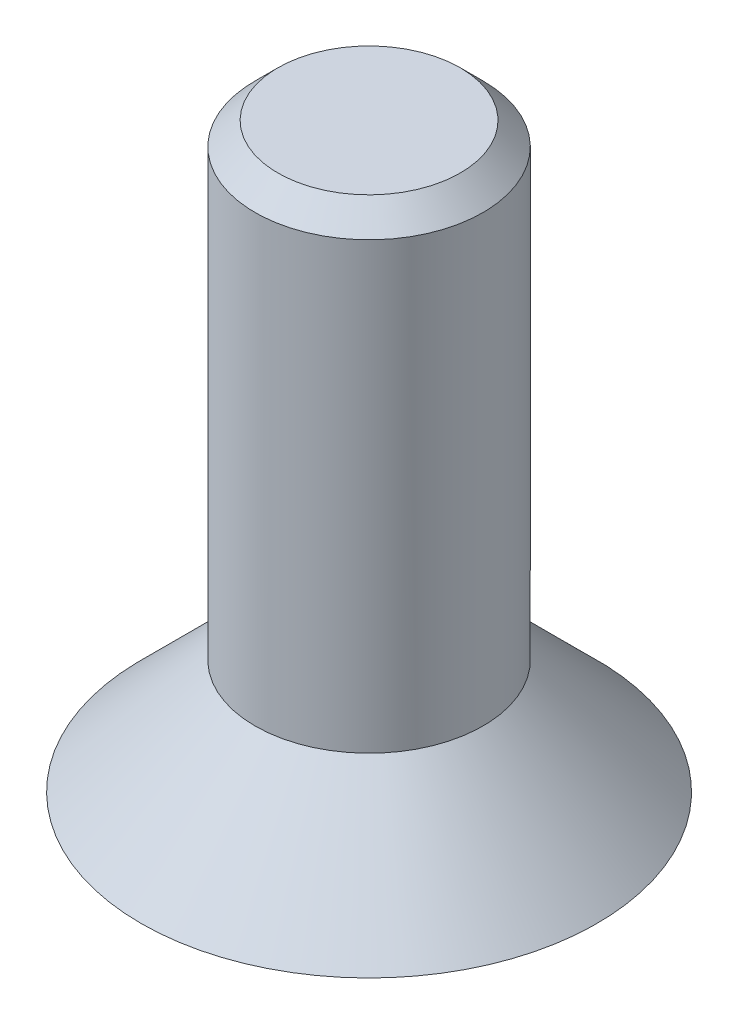
ISO-10303-21;
HEADER;
FILE_DESCRIPTION(('STEP AP214'),'2;1');
FILE_NAME('part.step','',(''),(''),'','','');
FILE_SCHEMA(('AUTOMOTIVE_DESIGN { 1 0 10303 214 1 1 1 1 }'));
ENDSEC;
DATA;
#1=APPLICATION_CONTEXT('core data for automotive mechanical design processes');
#2=APPLICATION_PROTOCOL_DEFINITION('international standard','automotive_design',2000,#1);
#3=PRODUCT_CONTEXT('',#1,'mechanical');
#4=PRODUCT('Part','Part','',(#3));
#5=PRODUCT_RELATED_PRODUCT_CATEGORY('part','',(#4));
#6=PRODUCT_DEFINITION_FORMATION('','',#4);
#7=PRODUCT_DEFINITION_CONTEXT('part definition',#1,'design');
#8=PRODUCT_DEFINITION('design','',#6,#7);
#9=PRODUCT_DEFINITION_SHAPE('','',#8);
#10=(LENGTH_UNIT() NAMED_UNIT(*) SI_UNIT(.MILLI.,.METRE.));
#11=(NAMED_UNIT(*) PLANE_ANGLE_UNIT() SI_UNIT($,.RADIAN.));
#12=(NAMED_UNIT(*) SI_UNIT($,.STERADIAN.) SOLID_ANGLE_UNIT());
#13=UNCERTAINTY_MEASURE_WITH_UNIT(LENGTH_MEASURE(1.E-05),#10,'distance_accuracy_value','');
#14=(GEOMETRIC_REPRESENTATION_CONTEXT(3) GLOBAL_UNCERTAINTY_ASSIGNED_CONTEXT((#13)) GLOBAL_UNIT_ASSIGNED_CONTEXT((#10,
#11,#12)) REPRESENTATION_CONTEXT('',''));
#15=CARTESIAN_POINT('',(0.,0.,0.));
#16=DIRECTION('',(0.,0.,1.));
#17=DIRECTION('',(1.,0.,0.));
#18=AXIS2_PLACEMENT_3D('',#15,#16,#17);
#19=CARTESIAN_POINT('',(0.,0.,0.));
#20=DIRECTION('',(0.,1.,0.));
#21=DIRECTION('',(0.,0.,1.));
#22=AXIS2_PLACEMENT_3D('',#19,#20,#21);
#23=PLANE('',#22);
#24=CARTESIAN_POINT('',(0.,0.,0.));
#25=DIRECTION('',(0.,1.,0.));
#26=DIRECTION('',(0.,0.,1.));
#27=AXIS2_PLACEMENT_3D('',#24,#25,#26);
#28=CIRCLE('',#27,2.);
#29=CARTESIAN_POINT('',(0.,0.,2.));
#30=VERTEX_POINT('',#29);
#31=EDGE_CURVE('E126',#30,#30,#28,.T.);
#32=ORIENTED_EDGE('',*,*,#31,.F.);
#33=EDGE_LOOP('',(#32));
#34=FACE_BOUND('',#33,.T.);
#35=DIRECTION('',(0.866025403784438,0.,0.5));
#36=VECTOR('',#35,1.);
#37=CARTESIAN_POINT('',(-0.75,0.,0.433012701892219));
#38=LINE('',#37,#36);
#39=CARTESIAN_POINT('',(-0.75,0.,0.433012701892219));
#40=VERTEX_POINT('',#39);
#41=CARTESIAN_POINT('',(0.,0.,0.866025403784438));
#42=VERTEX_POINT('',#41);
#43=EDGE_CURVE('E55',#40,#42,#38,.T.);
#44=ORIENTED_EDGE('',*,*,#43,.T.);
#45=DIRECTION('',(0.866025403784439,0.,-0.5));
#46=VECTOR('',#45,1.);
#47=CARTESIAN_POINT('',(0.,0.,0.866025403784438));
#48=LINE('',#47,#46);
#49=CARTESIAN_POINT('',(0.75,0.,0.43301270189222));
#50=VERTEX_POINT('',#49);
#51=EDGE_CURVE('E111',#42,#50,#48,.T.);
#52=ORIENTED_EDGE('',*,*,#51,.T.);
#53=DIRECTION('',(0.,0.,-1.));
#54=VECTOR('',#53,1.);
#55=CARTESIAN_POINT('',(0.75,0.,0.43301270189222));
#56=LINE('',#55,#54);
#57=CARTESIAN_POINT('',(0.75,0.,-0.43301270189222));
#58=VERTEX_POINT('',#57);
#59=EDGE_CURVE('E109',#50,#58,#56,.T.);
#60=ORIENTED_EDGE('',*,*,#59,.T.);
#61=DIRECTION('',(-0.866025403784439,0.,-0.5));
#62=VECTOR('',#61,1.);
#63=CARTESIAN_POINT('',(0.75,0.,-0.43301270189222));
#64=LINE('',#63,#62);
#65=CARTESIAN_POINT('',(0.,0.,-0.866025403784439));
#66=VERTEX_POINT('',#65);
#67=EDGE_CURVE('E90',#58,#66,#64,.T.);
#68=ORIENTED_EDGE('',*,*,#67,.T.);
#69=DIRECTION('',(-0.866025403784439,0.,0.5));
#70=VECTOR('',#69,1.);
#71=CARTESIAN_POINT('',(0.,0.,-0.866025403784439));
#72=LINE('',#71,#70);
#73=CARTESIAN_POINT('',(-0.75,0.,-0.43301270189222));
#74=VERTEX_POINT('',#73);
#75=EDGE_CURVE('E99',#66,#74,#72,.T.);
#76=ORIENTED_EDGE('',*,*,#75,.T.);
#77=DIRECTION('',(0.,0.,1.));
#78=VECTOR('',#77,1.);
#79=CARTESIAN_POINT('',(-0.75,0.,-0.43301270189222));
#80=LINE('',#79,#78);
#81=EDGE_CURVE('E105',#74,#40,#80,.T.);
#82=ORIENTED_EDGE('',*,*,#81,.T.);
#83=EDGE_LOOP('',(#44,#52,#60,#68,#76,#82));
#84=FACE_BOUND('',#83,.T.);
#85=ADVANCED_FACE('F39',(#34,#84),#23,.F.);
#86=CARTESIAN_POINT('',(-0.75,1.,0.433012701892219));
#87=DIRECTION('',(0.5,0.,-0.866025403784439));
#88=DIRECTION('',(-0.866025403784438,0.,-0.5));
#89=AXIS2_PLACEMENT_3D('',#86,#87,#88);
#90=PLANE('',#89);
#91=ORIENTED_EDGE('',*,*,#43,.F.);
#92=DIRECTION('',(0.,-1.,0.));
#93=VECTOR('',#92,1.);
#94=CARTESIAN_POINT('',(-0.75,1.,0.433012701892219));
#95=LINE('',#94,#93);
#96=CARTESIAN_POINT('',(-0.75,1.,0.433012701892219));
#97=VERTEX_POINT('',#96);
#98=EDGE_CURVE('E117',#97,#40,#95,.T.);
#99=ORIENTED_EDGE('',*,*,#98,.F.);
#100=DIRECTION('',(0.866025403784438,0.,0.5));
#101=VECTOR('',#100,1.);
#102=CARTESIAN_POINT('',(-0.75,1.,0.433012701892219));
#103=LINE('',#102,#101);
#104=CARTESIAN_POINT('',(0.,1.,0.866025403784438));
#105=VERTEX_POINT('',#104);
#106=EDGE_CURVE('E116',#97,#105,#103,.T.);
#107=ORIENTED_EDGE('',*,*,#106,.T.);
#108=DIRECTION('',(0.,-1.,0.));
#109=VECTOR('',#108,1.);
#110=CARTESIAN_POINT('',(0.,1.,0.866025403784438));
#111=LINE('',#110,#109);
#112=EDGE_CURVE('E124',#105,#42,#111,.T.);
#113=ORIENTED_EDGE('',*,*,#112,.T.);
#114=EDGE_LOOP('',(#91,#99,#107,#113));
#115=FACE_BOUND('',#114,.T.);
#116=ADVANCED_FACE('F145',(#115),#90,.T.);
#117=CARTESIAN_POINT('',(0.,1.,0.866025403784438));
#118=DIRECTION('',(-0.5,0.,-0.866025403784439));
#119=DIRECTION('',(-0.866025403784439,0.,0.5));
#120=AXIS2_PLACEMENT_3D('',#117,#118,#119);
#121=PLANE('',#120);
#122=ORIENTED_EDGE('',*,*,#51,.F.);
#123=ORIENTED_EDGE('',*,*,#112,.F.);
#124=DIRECTION('',(0.866025403784439,0.,-0.5));
#125=VECTOR('',#124,1.);
#126=CARTESIAN_POINT('',(0.,1.,0.866025403784438));
#127=LINE('',#126,#125);
#128=CARTESIAN_POINT('',(0.75,1.,0.43301270189222));
#129=VERTEX_POINT('',#128);
#130=EDGE_CURVE('E204',#105,#129,#127,.T.);
#131=ORIENTED_EDGE('',*,*,#130,.T.);
#132=DIRECTION('',(0.,-1.,0.));
#133=VECTOR('',#132,1.);
#134=CARTESIAN_POINT('',(0.75,1.,0.43301270189222));
#135=LINE('',#134,#133);
#136=EDGE_CURVE('E122',#129,#50,#135,.T.);
#137=ORIENTED_EDGE('',*,*,#136,.T.);
#138=EDGE_LOOP('',(#122,#123,#131,#137));
#139=FACE_BOUND('',#138,.T.);
#140=ADVANCED_FACE('F151',(#139),#121,.T.);
#141=CARTESIAN_POINT('',(0.75,1.,0.43301270189222));
#142=DIRECTION('',(-1.,0.,0.));
#143=DIRECTION('',(0.,0.,1.));
#144=AXIS2_PLACEMENT_3D('',#141,#142,#143);
#145=PLANE('',#144);
#146=ORIENTED_EDGE('',*,*,#59,.F.);
#147=ORIENTED_EDGE('',*,*,#136,.F.);
#148=DIRECTION('',(0.,0.,-1.));
#149=VECTOR('',#148,1.);
#150=CARTESIAN_POINT('',(0.75,1.,0.43301270189222));
#151=LINE('',#150,#149);
#152=CARTESIAN_POINT('',(0.75,1.,-0.43301270189222));
#153=VERTEX_POINT('',#152);
#154=EDGE_CURVE('E202',#129,#153,#151,.T.);
#155=ORIENTED_EDGE('',*,*,#154,.T.);
#156=DIRECTION('',(0.,-1.,0.));
#157=VECTOR('',#156,1.);
#158=CARTESIAN_POINT('',(0.75,1.,-0.43301270189222));
#159=LINE('',#158,#157);
#160=EDGE_CURVE('E95',#153,#58,#159,.T.);
#161=ORIENTED_EDGE('',*,*,#160,.T.);
#162=EDGE_LOOP('',(#146,#147,#155,#161));
#163=FACE_BOUND('',#162,.T.);
#164=ADVANCED_FACE('F183',(#163),#145,.T.);
#165=CARTESIAN_POINT('',(0.75,1.,-0.43301270189222));
#166=DIRECTION('',(-0.5,0.,0.866025403784439));
#167=DIRECTION('',(0.866025403784439,0.,0.5));
#168=AXIS2_PLACEMENT_3D('',#165,#166,#167);
#169=PLANE('',#168);
#170=ORIENTED_EDGE('',*,*,#67,.F.);
#171=ORIENTED_EDGE('',*,*,#160,.F.);
#172=DIRECTION('',(-0.866025403784439,0.,-0.5));
#173=VECTOR('',#172,1.);
#174=CARTESIAN_POINT('',(0.75,1.,-0.43301270189222));
#175=LINE('',#174,#173);
#176=CARTESIAN_POINT('',(0.,1.,-0.866025403784439));
#177=VERTEX_POINT('',#176);
#178=EDGE_CURVE('E64',#153,#177,#175,.T.);
#179=ORIENTED_EDGE('',*,*,#178,.T.);
#180=DIRECTION('',(0.,-1.,0.));
#181=VECTOR('',#180,1.);
#182=CARTESIAN_POINT('',(0.,1.,-0.866025403784439));
#183=LINE('',#182,#181);
#184=EDGE_CURVE('E85',#177,#66,#183,.T.);
#185=ORIENTED_EDGE('',*,*,#184,.T.);
#186=EDGE_LOOP('',(#170,#171,#179,#185));
#187=FACE_BOUND('',#186,.T.);
#188=ADVANCED_FACE('F87',(#187),#169,.T.);
#189=CARTESIAN_POINT('',(0.,1.,-0.866025403784439));
#190=DIRECTION('',(0.5,0.,0.866025403784439));
#191=DIRECTION('',(0.866025403784439,0.,-0.5));
#192=AXIS2_PLACEMENT_3D('',#189,#190,#191);
#193=PLANE('',#192);
#194=ORIENTED_EDGE('',*,*,#75,.F.);
#195=ORIENTED_EDGE('',*,*,#184,.F.);
#196=DIRECTION('',(-0.866025403784439,0.,0.5));
#197=VECTOR('',#196,1.);
#198=CARTESIAN_POINT('',(0.,1.,-0.866025403784439));
#199=LINE('',#198,#197);
#200=CARTESIAN_POINT('',(-0.75,1.,-0.43301270189222));
#201=VERTEX_POINT('',#200);
#202=EDGE_CURVE('E199',#177,#201,#199,.T.);
#203=ORIENTED_EDGE('',*,*,#202,.T.);
#204=DIRECTION('',(0.,-1.,0.));
#205=VECTOR('',#204,1.);
#206=CARTESIAN_POINT('',(-0.75,1.,-0.43301270189222));
#207=LINE('',#206,#205);
#208=EDGE_CURVE('E96',#201,#74,#207,.T.);
#209=ORIENTED_EDGE('',*,*,#208,.T.);
#210=EDGE_LOOP('',(#194,#195,#203,#209));
#211=FACE_BOUND('',#210,.T.);
#212=ADVANCED_FACE('F100',(#211),#193,.T.);
#213=CARTESIAN_POINT('',(-0.75,1.,-0.43301270189222));
#214=DIRECTION('',(1.,0.,0.));
#215=DIRECTION('',(0.,0.,-1.));
#216=AXIS2_PLACEMENT_3D('',#213,#214,#215);
#217=PLANE('',#216);
#218=ORIENTED_EDGE('',*,*,#81,.F.);
#219=ORIENTED_EDGE('',*,*,#208,.F.);
#220=DIRECTION('',(0.,0.,1.));
#221=VECTOR('',#220,1.);
#222=CARTESIAN_POINT('',(-0.75,1.,-0.43301270189222));
#223=LINE('',#222,#221);
#224=EDGE_CURVE('E119',#201,#97,#223,.T.);
#225=ORIENTED_EDGE('',*,*,#224,.T.);
#226=ORIENTED_EDGE('',*,*,#98,.T.);
#227=EDGE_LOOP('',(#218,#219,#225,#226));
#228=FACE_BOUND('',#227,.T.);
#229=ADVANCED_FACE('F161',(#228),#217,.T.);
#230=CARTESIAN_POINT('',(0.,1.,0.));
#231=DIRECTION('',(0.,-1.,0.));
#232=DIRECTION('',(0.,0.,-1.));
#233=AXIS2_PLACEMENT_3D('',#230,#231,#232);
#234=CONICAL_SURFACE('',#233,0.999999999999999,0.785398163397446);
#235=ORIENTED_EDGE('',*,*,#31,.T.);
#236=EDGE_LOOP('',(#235));
#237=FACE_BOUND('',#236,.T.);
#238=CARTESIAN_POINT('',(0.,1.,0.));
#239=DIRECTION('',(0.,1.,0.));
#240=DIRECTION('',(0.,0.,1.));
#241=AXIS2_PLACEMENT_3D('',#238,#239,#240);
#242=CIRCLE('',#241,0.999999999999999);
#243=CARTESIAN_POINT('',(0.,1.,0.999999999999999));
#244=VERTEX_POINT('',#243);
#245=EDGE_CURVE('E129',#244,#244,#242,.T.);
#246=ORIENTED_EDGE('',*,*,#245,.F.);
#247=EDGE_LOOP('',(#246));
#248=FACE_BOUND('',#247,.T.);
#249=ADVANCED_FACE('F156',(#237,#248),#234,.T.);
#250=CARTESIAN_POINT('',(0.,1.,0.));
#251=DIRECTION('',(0.,1.,0.));
#252=DIRECTION('',(0.,0.,1.));
#253=AXIS2_PLACEMENT_3D('',#250,#251,#252);
#254=PLANE('',#253);
#255=ORIENTED_EDGE('',*,*,#130,.F.);
#256=ORIENTED_EDGE('',*,*,#106,.F.);
#257=ORIENTED_EDGE('',*,*,#224,.F.);
#258=ORIENTED_EDGE('',*,*,#202,.F.);
#259=ORIENTED_EDGE('',*,*,#178,.F.);
#260=ORIENTED_EDGE('',*,*,#154,.F.);
#261=EDGE_LOOP('',(#255,#256,#257,#258,#259,#260));
#262=FACE_BOUND('',#261,.T.);
#263=ADVANCED_FACE('F160',(#262),#254,.F.);
#264=CARTESIAN_POINT('',(0.,5.1,0.));
#265=DIRECTION('',(0.,-1.,0.));
#266=DIRECTION('',(0.,0.,-1.));
#267=AXIS2_PLACEMENT_3D('',#264,#265,#266);
#268=CYLINDRICAL_SURFACE('',#267,1.);
#269=CARTESIAN_POINT('',(0.,4.9,0.));
#270=DIRECTION('',(0.,1.,0.));
#271=DIRECTION('',(0.,0.,1.));
#272=AXIS2_PLACEMENT_3D('',#269,#270,#271);
#273=CIRCLE('',#272,1.);
#274=CARTESIAN_POINT('',(0.,4.9,-1.));
#275=VERTEX_POINT('',#274);
#276=EDGE_CURVE('E11',#275,#275,#273,.F.);
#277=ORIENTED_EDGE('',*,*,#276,.T.);
#278=EDGE_LOOP('',(#277));
#279=FACE_BOUND('',#278,.T.);
#280=ORIENTED_EDGE('',*,*,#245,.T.);
#281=EDGE_LOOP('',(#280));
#282=FACE_BOUND('',#281,.T.);
#283=ADVANCED_FACE('F141',(#279,#282),#268,.T.);
#284=CARTESIAN_POINT('',(0.,5.1,0.));
#285=DIRECTION('',(0.,1.,0.));
#286=DIRECTION('',(0.,0.,1.));
#287=AXIS2_PLACEMENT_3D('',#284,#285,#286);
#288=PLANE('',#287);
#289=CARTESIAN_POINT('',(0.,5.1,0.));
#290=DIRECTION('',(0.,1.,0.));
#291=DIRECTION('',(0.,0.,1.));
#292=AXIS2_PLACEMENT_3D('',#289,#290,#291);
#293=CIRCLE('',#292,0.800000000000001);
#294=CARTESIAN_POINT('',(0.,5.1,-0.800000000000002));
#295=VERTEX_POINT('',#294);
#296=EDGE_CURVE('E48',#295,#295,#293,.T.);
#297=ORIENTED_EDGE('',*,*,#296,.T.);
#298=EDGE_LOOP('',(#297));
#299=FACE_BOUND('',#298,.T.);
#300=ADVANCED_FACE('F134',(#299),#288,.T.);
#301=CARTESIAN_POINT('',(0.,5.1,0.));
#302=DIRECTION('',(0.,-1.,0.));
#303=DIRECTION('',(0.,0.,-1.));
#304=AXIS2_PLACEMENT_3D('',#301,#302,#303);
#305=CONICAL_SURFACE('',#304,0.800000000000001,0.785398163397446);
#306=CARTESIAN_POINT('',(0.,4.9,-1.));
#307=CARTESIAN_POINT('',(0.,4.90208333333333,-0.997916666666667));
#308=CARTESIAN_POINT('',(0.,4.90416666666667,-0.995833333333334));
#309=CARTESIAN_POINT('',(0.,4.90833333333333,-0.991666666666667));
#310=CARTESIAN_POINT('',(0.,4.91041666666667,-0.989583333333334));
#311=CARTESIAN_POINT('',(0.,4.91458333333333,-0.985416666666667));
#312=CARTESIAN_POINT('',(0.,4.91666666666667,-0.983333333333334));
#313=CARTESIAN_POINT('',(0.,4.92083333333333,-0.979166666666667));
#314=CARTESIAN_POINT('',(0.,4.92291666666667,-0.977083333333334));
#315=CARTESIAN_POINT('',(0.,4.92708333333333,-0.972916666666667));
#316=CARTESIAN_POINT('',(0.,4.92916666666667,-0.970833333333334));
#317=CARTESIAN_POINT('',(0.,4.93333333333333,-0.966666666666667));
#318=CARTESIAN_POINT('',(0.,4.93541666666667,-0.964583333333334));
#319=CARTESIAN_POINT('',(0.,4.93958333333333,-0.960416666666667));
#320=CARTESIAN_POINT('',(0.,4.94166666666667,-0.958333333333334));
#321=CARTESIAN_POINT('',(0.,4.94583333333333,-0.954166666666667));
#322=CARTESIAN_POINT('',(0.,4.94791666666667,-0.952083333333334));
#323=CARTESIAN_POINT('',(0.,4.95208333333333,-0.947916666666667));
#324=CARTESIAN_POINT('',(0.,4.95416666666667,-0.945833333333334));
#325=CARTESIAN_POINT('',(0.,4.95833333333333,-0.941666666666667));
#326=CARTESIAN_POINT('',(0.,4.96041666666667,-0.939583333333334));
#327=CARTESIAN_POINT('',(0.,4.96458333333333,-0.935416666666667));
#328=CARTESIAN_POINT('',(0.,4.96666666666667,-0.933333333333334));
#329=CARTESIAN_POINT('',(0.,4.97083333333333,-0.929166666666668));
#330=CARTESIAN_POINT('',(0.,4.97291666666667,-0.927083333333334));
#331=CARTESIAN_POINT('',(0.,4.97708333333333,-0.922916666666668));
#332=CARTESIAN_POINT('',(0.,4.97916666666667,-0.920833333333334));
#333=CARTESIAN_POINT('',(0.,4.98333333333333,-0.916666666666668));
#334=CARTESIAN_POINT('',(0.,4.98541666666667,-0.914583333333334));
#335=CARTESIAN_POINT('',(0.,4.98958333333333,-0.910416666666668));
#336=CARTESIAN_POINT('',(0.,4.99166666666667,-0.908333333333334));
#337=CARTESIAN_POINT('',(0.,4.99583333333333,-0.904166666666668));
#338=CARTESIAN_POINT('',(0.,4.99791666666667,-0.902083333333334));
#339=CARTESIAN_POINT('',(0.,5.00208333333333,-0.897916666666668));
#340=CARTESIAN_POINT('',(0.,5.00416666666667,-0.895833333333334));
#341=CARTESIAN_POINT('',(0.,5.00833333333333,-0.891666666666668));
#342=CARTESIAN_POINT('',(0.,5.01041666666667,-0.889583333333335));
#343=CARTESIAN_POINT('',(0.,5.01458333333333,-0.885416666666668));
#344=CARTESIAN_POINT('',(0.,5.01666666666667,-0.883333333333334));
#345=CARTESIAN_POINT('',(0.,5.02083333333333,-0.879166666666668));
#346=CARTESIAN_POINT('',(0.,5.02291666666667,-0.877083333333335));
#347=CARTESIAN_POINT('',(0.,5.02708333333333,-0.872916666666668));
#348=CARTESIAN_POINT('',(0.,5.02916666666667,-0.870833333333335));
#349=CARTESIAN_POINT('',(0.,5.03333333333333,-0.866666666666668));
#350=CARTESIAN_POINT('',(0.,5.03541666666667,-0.864583333333335));
#351=CARTESIAN_POINT('',(0.,5.03958333333333,-0.860416666666668));
#352=CARTESIAN_POINT('',(0.,5.04166666666667,-0.858333333333335));
#353=CARTESIAN_POINT('',(0.,5.04583333333333,-0.854166666666668));
#354=CARTESIAN_POINT('',(0.,5.04791666666667,-0.852083333333335));
#355=CARTESIAN_POINT('',(0.,5.05208333333333,-0.847916666666668));
#356=CARTESIAN_POINT('',(0.,5.05416666666667,-0.845833333333335));
#357=CARTESIAN_POINT('',(0.,5.05833333333333,-0.841666666666668));
#358=CARTESIAN_POINT('',(0.,5.06041666666667,-0.839583333333335));
#359=CARTESIAN_POINT('',(0.,5.06458333333333,-0.835416666666668));
#360=CARTESIAN_POINT('',(0.,5.06666666666667,-0.833333333333335));
#361=CARTESIAN_POINT('',(0.,5.07083333333333,-0.829166666666668));
#362=CARTESIAN_POINT('',(0.,5.07291666666667,-0.827083333333335));
#363=CARTESIAN_POINT('',(0.,5.07708333333333,-0.822916666666668));
#364=CARTESIAN_POINT('',(0.,5.07916666666667,-0.820833333333335));
#365=CARTESIAN_POINT('',(0.,5.08333333333333,-0.816666666666668));
#366=CARTESIAN_POINT('',(0.,5.08541666666667,-0.814583333333335));
#367=CARTESIAN_POINT('',(0.,5.08958333333333,-0.810416666666668));
#368=CARTESIAN_POINT('',(0.,5.09166666666667,-0.808333333333335));
#369=CARTESIAN_POINT('',(0.,5.09583333333333,-0.804166666666668));
#370=CARTESIAN_POINT('',(0.,5.09791666666667,-0.802083333333335));
#371=CARTESIAN_POINT('',(0.,5.1,-0.800000000000002));
#372=B_SPLINE_CURVE_WITH_KNOTS('',3,(#306,#307,#308,#309,#310,#311,#312,#313,#314,#315,#316,
#317,#318,#319,#320,#321,#322,#323,#324,#325,#326,#327,#328,#329,#330,#331,#332,#333,#334,#335,
#336,#337,#338,#339,#340,#341,#342,#343,#344,#345,#346,#347,#348,#349,#350,#351,#352,#353,#354,
#355,#356,#357,#358,#359,#360,#361,#362,#363,#364,#365,#366,#367,#368,#369,#370,#371),
.UNSPECIFIED.,.F.,.F.,(4,2,2,2,2,2,2,2,2,2,2,2,2,2,2,2,2,2,2,2,2,2,2,2,2,2,2,2,2,2,2,2,4),(0.,
0.00883883476483194,0.0176776695296639,0.0265165042944958,0.0353553390593278,0.0441941738241591,
0.053033008588991,0.061871843353823,0.0707106781186549,0.0795495128834869,0.0883883476483182,
0.0972271824131501,0.106066017177982,0.114904851942814,0.123743686707645,0.132582521472477,
0.141421356237309,0.150260191002141,0.159099025766973,0.167937860531804,0.176776695296636,
0.185615530061468,0.1944543648263,0.203293199591132,0.212132034355964,0.220970869120795,
0.229809703885627,0.238648538650459,0.247487373415291,0.256326208180123,0.265165042944955,
0.274003877709787,0.282842712474619),.UNSPECIFIED.);
#373=EDGE_CURVE('BSEAM42',#275,#295,#372,.T.);
#374=ORIENTED_EDGE('',*,*,#276,.F.);
#375=ORIENTED_EDGE('',*,*,#296,.F.);
#376=ORIENTED_EDGE('',*,*,#373,.T.);
#377=ORIENTED_EDGE('',*,*,#373,.F.);
#378=EDGE_LOOP('',(#374,#376,#375,#377));
#379=FACE_BOUND('',#378,.T.);
#380=ADVANCED_FACE('F42',(#379),#305,.T.);
#381=CLOSED_SHELL('',(#85,#116,#140,#164,#188,#212,#229,#249,#263,#283,#300,#380));
#382=MANIFOLD_SOLID_BREP('B2',#381);
#383=ADVANCED_BREP_SHAPE_REPRESENTATION('',(#18,#382),#14);
#384=SHAPE_DEFINITION_REPRESENTATION(#9,#383);
ENDSEC;
END-ISO-10303-21;
